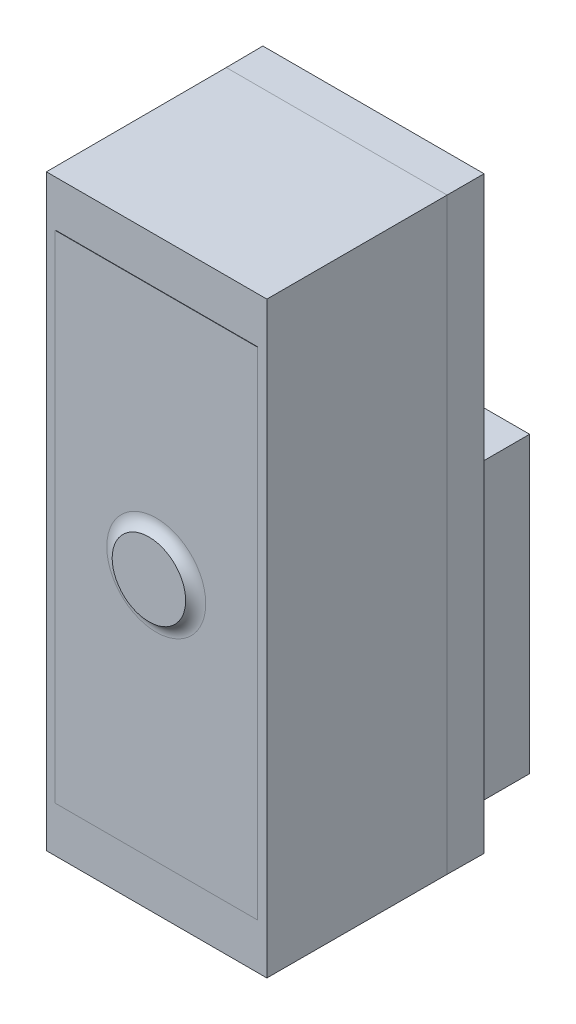
ISO-10303-21;
HEADER;
FILE_DESCRIPTION(('STEP AP214'),'2;1');
FILE_NAME('part.step','',(''),(''),'','','');
FILE_SCHEMA(('AUTOMOTIVE_DESIGN { 1 0 10303 214 1 1 1 1 }'));
ENDSEC;
DATA;
#1=APPLICATION_CONTEXT('core data for automotive mechanical design processes');
#2=APPLICATION_PROTOCOL_DEFINITION('international standard','automotive_design',2000,#1);
#3=PRODUCT_CONTEXT('',#1,'mechanical');
#4=PRODUCT('Part','Part','',(#3));
#5=PRODUCT_RELATED_PRODUCT_CATEGORY('part','',(#4));
#6=PRODUCT_DEFINITION_FORMATION('','',#4);
#7=PRODUCT_DEFINITION_CONTEXT('part definition',#1,'design');
#8=PRODUCT_DEFINITION('design','',#6,#7);
#9=PRODUCT_DEFINITION_SHAPE('','',#8);
#10=(LENGTH_UNIT() NAMED_UNIT(*) SI_UNIT(.MILLI.,.METRE.));
#11=(NAMED_UNIT(*) PLANE_ANGLE_UNIT() SI_UNIT($,.RADIAN.));
#12=(NAMED_UNIT(*) SI_UNIT($,.STERADIAN.) SOLID_ANGLE_UNIT());
#13=UNCERTAINTY_MEASURE_WITH_UNIT(LENGTH_MEASURE(1.E-05),#10,'distance_accuracy_value','');
#14=(GEOMETRIC_REPRESENTATION_CONTEXT(3) GLOBAL_UNCERTAINTY_ASSIGNED_CONTEXT((#13)) GLOBAL_UNIT_ASSIGNED_CONTEXT((#10,
#11,#12)) REPRESENTATION_CONTEXT('',''));
#15=CARTESIAN_POINT('',(0.,0.,0.));
#16=DIRECTION('',(0.,0.,1.));
#17=DIRECTION('',(1.,0.,0.));
#18=AXIS2_PLACEMENT_3D('',#15,#16,#17);
#19=CARTESIAN_POINT('',(-7.53006344851297,3.82801421890761,5.11));
#20=DIRECTION('',(0.,0.,1.));
#21=DIRECTION('',(1.,0.,0.));
#22=AXIS2_PLACEMENT_3D('',#19,#20,#21);
#23=PLANE('',#22);
#24=CARTESIAN_POINT('',(-7.53006344851297,3.82801421890761,5.11));
#25=DIRECTION('',(0.,0.,-1.));
#26=DIRECTION('',(1.,0.,0.));
#27=AXIS2_PLACEMENT_3D('',#24,#25,#26);
#28=CIRCLE('',#27,0.999999999999998);
#29=CARTESIAN_POINT('',(-8.53006344851297,3.82801421890761,5.11));
#30=VERTEX_POINT('',#29);
#31=CARTESIAN_POINT('',(-6.53006344851297,3.82801421890761,5.11));
#32=VERTEX_POINT('',#31);
#33=EDGE_CURVE('E96',#30,#32,#28,.F.);
#34=ORIENTED_EDGE('',*,*,#33,.T.);
#35=CARTESIAN_POINT('',(-7.53006344851297,3.82801421890761,5.11));
#36=DIRECTION('',(0.,0.,-1.));
#37=DIRECTION('',(-1.,0.,0.));
#38=AXIS2_PLACEMENT_3D('',#35,#36,#37);
#39=CIRCLE('',#38,1.);
#40=EDGE_CURVE('E93',#32,#30,#39,.F.);
#41=ORIENTED_EDGE('',*,*,#40,.T.);
#42=EDGE_LOOP('',(#34,#41));
#43=FACE_BOUND('',#42,.T.);
#44=ADVANCED_FACE('F16',(#43),#23,.T.);
#45=CARTESIAN_POINT('',(-9.28006344851297,5.81801421890761,-1.75));
#46=DIRECTION('',(0.,1.,0.));
#47=DIRECTION('',(0.,0.,1.));
#48=AXIS2_PLACEMENT_3D('',#45,#46,#47);
#49=PLANE('',#48);
#50=CARTESIAN_POINT('',(-9.28006344851297,5.81801421890761,-1.75));
#51=DIRECTION('',(0.,-1.,0.));
#52=DIRECTION('',(0.,0.,1.));
#53=AXIS2_PLACEMENT_3D('',#50,#51,#52);
#54=CIRCLE('',#53,0.375000000000001);
#55=CARTESIAN_POINT('',(-9.28006344851297,5.81801421890761,-1.375));
#56=VERTEX_POINT('',#55);
#57=CARTESIAN_POINT('',(-9.28006344851297,5.81801421890761,-2.125));
#58=VERTEX_POINT('',#57);
#59=EDGE_CURVE('E161',#56,#58,#54,.T.);
#60=ORIENTED_EDGE('',*,*,#59,.F.);
#61=CARTESIAN_POINT('',(-9.28006344851297,5.81801421890761,-1.75));
#62=DIRECTION('',(0.,-1.,0.));
#63=DIRECTION('',(0.,0.,-1.));
#64=AXIS2_PLACEMENT_3D('',#61,#62,#63);
#65=CIRCLE('',#64,0.375000000000001);
#66=EDGE_CURVE('E104',#58,#56,#65,.T.);
#67=ORIENTED_EDGE('',*,*,#66,.F.);
#68=EDGE_LOOP('',(#60,#67));
#69=FACE_BOUND('',#68,.T.);
#70=ADVANCED_FACE('F132',(#69),#49,.T.);
#71=CARTESIAN_POINT('',(-7.53006344851297,3.82801421890761,5.31));
#72=DIRECTION('',(0.,0.,-1.));
#73=DIRECTION('',(-1.,0.,0.));
#74=AXIS2_PLACEMENT_3D('',#71,#72,#73);
#75=TOROIDAL_SURFACE('',#74,1.34641016151377,0.4);
#76=CARTESIAN_POINT('',(-7.53006344851297,3.82801421890761,4.91));
#77=DIRECTION('',(0.,0.,1.));
#78=DIRECTION('',(1.,0.,0.));
#79=AXIS2_PLACEMENT_3D('',#76,#77,#78);
#80=CIRCLE('',#79,1.34641016151377);
#81=CARTESIAN_POINT('',(-6.1836532869992,3.82801421890761,4.91));
#82=VERTEX_POINT('',#81);
#83=CARTESIAN_POINT('',(-8.87647361002675,3.82801421890761,4.91));
#84=VERTEX_POINT('',#83);
#85=EDGE_CURVE('E148',#82,#84,#80,.T.);
#86=ORIENTED_EDGE('',*,*,#85,.T.);
#87=CARTESIAN_POINT('',(-7.53006344851297,3.82801421890761,4.91));
#88=DIRECTION('',(0.,0.,1.));
#89=DIRECTION('',(-1.,0.,0.));
#90=AXIS2_PLACEMENT_3D('',#87,#88,#89);
#91=CIRCLE('',#90,1.34641016151378);
#92=EDGE_CURVE('E190',#84,#82,#91,.T.);
#93=ORIENTED_EDGE('',*,*,#92,.T.);
#94=EDGE_LOOP('',(#86,#93));
#95=FACE_BOUND('',#94,.T.);
#96=ORIENTED_EDGE('',*,*,#33,.F.);
#97=ORIENTED_EDGE('',*,*,#40,.F.);
#98=EDGE_LOOP('',(#96,#97));
#99=FACE_BOUND('',#98,.T.);
#100=ADVANCED_FACE('F98',(#95,#99),#75,.F.);
#101=CARTESIAN_POINT('',(-9.28006344851297,5.81801421890761,-1.75));
#102=DIRECTION('',(0.,-1.,0.));
#103=DIRECTION('',(0.,0.,-1.));
#104=AXIS2_PLACEMENT_3D('',#101,#102,#103);
#105=CYLINDRICAL_SURFACE('',#104,0.375000000000001);
#106=ORIENTED_EDGE('',*,*,#66,.T.);
#107=ORIENTED_EDGE('',*,*,#59,.T.);
#108=EDGE_LOOP('',(#106,#107));
#109=FACE_BOUND('',#108,.T.);
#110=CARTESIAN_POINT('',(-9.28006344851297,4.81801421890761,-1.75));
#111=DIRECTION('',(0.,1.,0.));
#112=DIRECTION('',(0.,0.,-1.));
#113=AXIS2_PLACEMENT_3D('',#110,#111,#112);
#114=CIRCLE('',#113,0.375000000000001);
#115=CARTESIAN_POINT('',(-9.28006344851297,4.81801421890761,-2.125));
#116=VERTEX_POINT('',#115);
#117=CARTESIAN_POINT('',(-9.28006344851297,4.81801421890761,-1.375));
#118=VERTEX_POINT('',#117);
#119=EDGE_CURVE('E508',#116,#118,#114,.T.);
#120=ORIENTED_EDGE('',*,*,#119,.T.);
#121=CARTESIAN_POINT('',(-9.28006344851297,4.81801421890761,-1.75));
#122=DIRECTION('',(0.,1.,0.));
#123=DIRECTION('',(0.,0.,1.));
#124=AXIS2_PLACEMENT_3D('',#121,#122,#123);
#125=CIRCLE('',#124,0.375000000000001);
#126=EDGE_CURVE('E509',#118,#116,#125,.T.);
#127=ORIENTED_EDGE('',*,*,#126,.T.);
#128=EDGE_LOOP('',(#120,#127));
#129=FACE_BOUND('',#128,.T.);
#130=ADVANCED_FACE('F131',(#109,#129),#105,.T.);
#131=CARTESIAN_POINT('',(0.,0.,-2.5));
#132=DIRECTION('',(0.,0.,1.));
#133=DIRECTION('',(1.,0.,0.));
#134=AXIS2_PLACEMENT_3D('',#131,#132,#133);
#135=PLANE('',#134);
#136=DIRECTION('',(1.,0.,0.));
#137=VECTOR('',#136,1.);
#138=CARTESIAN_POINT('',(-4.78006344851297,-3.18198578109239,-2.5));
#139=LINE('',#138,#137);
#140=CARTESIAN_POINT('',(-4.78006344851297,-3.18198578109239,-2.5));
#141=VERTEX_POINT('',#140);
#142=CARTESIAN_POINT('',(-10.280063448513,-3.18198578109239,-2.5));
#143=VERTEX_POINT('',#142);
#144=EDGE_CURVE('E191',#141,#143,#139,.F.);
#145=ORIENTED_EDGE('',*,*,#144,.T.);
#146=DIRECTION('',(0.,1.,0.));
#147=VECTOR('',#146,1.);
#148=CARTESIAN_POINT('',(-10.280063448513,-3.18198578109239,-2.5));
#149=LINE('',#148,#147);
#150=CARTESIAN_POINT('',(-10.280063448513,4.81801421890761,-2.5));
#151=VERTEX_POINT('',#150);
#152=EDGE_CURVE('E550',#143,#151,#149,.T.);
#153=ORIENTED_EDGE('',*,*,#152,.T.);
#154=DIRECTION('',(1.,0.,0.));
#155=VECTOR('',#154,1.);
#156=CARTESIAN_POINT('',(-4.78006344851297,4.81801421890761,-2.5));
#157=LINE('',#156,#155);
#158=CARTESIAN_POINT('',(-4.78006344851297,4.81801421890761,-2.5));
#159=VERTEX_POINT('',#158);
#160=EDGE_CURVE('E512',#151,#159,#157,.T.);
#161=ORIENTED_EDGE('',*,*,#160,.T.);
#162=DIRECTION('',(0.,1.,0.));
#163=VECTOR('',#162,1.);
#164=CARTESIAN_POINT('',(-4.78006344851297,-3.18198578109239,-2.5));
#165=LINE('',#164,#163);
#166=EDGE_CURVE('E193',#159,#141,#165,.F.);
#167=ORIENTED_EDGE('',*,*,#166,.T.);
#168=EDGE_LOOP('',(#145,#153,#161,#167));
#169=FACE_BOUND('',#168,.T.);
#170=ADVANCED_FACE('F673',(#169),#135,.F.);
#171=CARTESIAN_POINT('',(0.,0.,4.91));
#172=DIRECTION('',(0.,0.,-1.));
#173=DIRECTION('',(-1.,0.,0.));
#174=AXIS2_PLACEMENT_3D('',#171,#172,#173);
#175=PLANE('',#174);
#176=DIRECTION('',(1.,0.,0.));
#177=VECTOR('',#176,1.);
#178=CARTESIAN_POINT('',(-10.280063448513,10.5780142189076,4.91));
#179=LINE('',#178,#177);
#180=CARTESIAN_POINT('',(-4.78006344851297,10.5780142189076,4.91));
#181=VERTEX_POINT('',#180);
#182=CARTESIAN_POINT('',(-10.280063448513,10.5780142189076,4.91));
#183=VERTEX_POINT('',#182);
#184=EDGE_CURVE('E557',#181,#183,#179,.F.);
#185=ORIENTED_EDGE('',*,*,#184,.T.);
#186=DIRECTION('',(0.,1.,0.));
#187=VECTOR('',#186,1.);
#188=CARTESIAN_POINT('',(-10.280063448513,-2.92198578109239,4.91));
#189=LINE('',#188,#187);
#190=CARTESIAN_POINT('',(-10.280063448513,-2.92198578109239,4.91));
#191=VERTEX_POINT('',#190);
#192=EDGE_CURVE('E623',#183,#191,#189,.F.);
#193=ORIENTED_EDGE('',*,*,#192,.T.);
#194=DIRECTION('',(1.,0.,0.));
#195=VECTOR('',#194,1.);
#196=CARTESIAN_POINT('',(-10.280063448513,-2.92198578109239,4.91));
#197=LINE('',#196,#195);
#198=CARTESIAN_POINT('',(-4.78006344851297,-2.92198578109239,4.91));
#199=VERTEX_POINT('',#198);
#200=EDGE_CURVE('E631',#191,#199,#197,.T.);
#201=ORIENTED_EDGE('',*,*,#200,.T.);
#202=DIRECTION('',(0.,1.,0.));
#203=VECTOR('',#202,1.);
#204=CARTESIAN_POINT('',(-4.78006344851297,-2.92198578109239,4.91));
#205=LINE('',#204,#203);
#206=EDGE_CURVE('E559',#199,#181,#205,.T.);
#207=ORIENTED_EDGE('',*,*,#206,.T.);
#208=EDGE_LOOP('',(#185,#193,#201,#207));
#209=FACE_BOUND('',#208,.T.);
#210=ORIENTED_EDGE('',*,*,#92,.F.);
#211=ORIENTED_EDGE('',*,*,#85,.F.);
#212=EDGE_LOOP('',(#210,#211));
#213=FACE_BOUND('',#212,.T.);
#214=ADVANCED_FACE('F269',(#209,#213),#175,.F.);
#215=CARTESIAN_POINT('',(-4.52006344851297,0.,-1.));
#216=DIRECTION('',(-1.,0.,0.));
#217=DIRECTION('',(0.,0.,1.));
#218=AXIS2_PLACEMENT_3D('',#215,#216,#217);
#219=PLANE('',#218);
#220=CARTESIAN_POINT('',(-4.52006344851297,-4.18198578109239,0.));
#221=DIRECTION('',(0.,0.,-1.));
#222=VECTOR('',#221,1.);
#223=LINE('',#220,#222);
#224=CARTESIAN_POINT('',(-4.52506344851297,-4.17698578109239,0.));
#225=VERTEX_POINT('',#224);
#226=CARTESIAN_POINT('',(-4.52006344851297,-4.18198578109239,-1.));
#227=VERTEX_POINT('',#226);
#228=EDGE_CURVE('E251',#225,#227,#223,.T.);
#229=ORIENTED_EDGE('',*,*,#228,.T.);
#230=DIRECTION('',(0.,1.,0.));
#231=VECTOR('',#230,1.);
#232=CARTESIAN_POINT('',(-4.52006344851297,0.,-1.));
#233=LINE('',#232,#231);
#234=CARTESIAN_POINT('',(-4.52006344851297,11.8380142189076,-1.));
#235=VERTEX_POINT('',#234);
#236=EDGE_CURVE('E256',#235,#227,#233,.F.);
#237=ORIENTED_EDGE('',*,*,#236,.F.);
#238=CARTESIAN_POINT('',(-4.52506344851297,11.8380142189076,0.));
#239=DIRECTION('',(0.00499993750117165,0.,-0.99998750023437));
#240=VECTOR('',#239,1.);
#241=LINE('',#238,#240);
#242=CARTESIAN_POINT('',(-4.52506344851297,11.8330142189076,0.));
#243=VERTEX_POINT('',#242);
#244=EDGE_CURVE('E491',#243,#235,#241,.T.);
#245=ORIENTED_EDGE('',*,*,#244,.F.);
#246=CARTESIAN_POINT('',(-4.53006344851297,-4.17698578109238,0.));
#247=DIRECTION('',(0.,1.,0.));
#248=VECTOR('',#247,1.);
#249=LINE('',#246,#248);
#250=EDGE_CURVE('E580',#225,#243,#249,.T.);
#251=ORIENTED_EDGE('',*,*,#250,.F.);
#252=EDGE_LOOP('',(#229,#237,#245,#251));
#253=FACE_BOUND('',#252,.T.);
#254=ADVANCED_FACE('F258',(#253),#219,.F.);
#255=CARTESIAN_POINT('',(-4.78006344851297,-3.18198578109239,-2.5));
#256=DIRECTION('',(0.,1.,0.));
#257=DIRECTION('',(0.,0.,1.));
#258=AXIS2_PLACEMENT_3D('',#255,#256,#257);
#259=PLANE('',#258);
#260=DIRECTION('',(0.,0.,-1.));
#261=VECTOR('',#260,1.);
#262=CARTESIAN_POINT('',(-10.280063448513,-3.18198578109239,-2.5));
#263=LINE('',#262,#261);
#264=CARTESIAN_POINT('',(-10.280063448513,-3.18198578109239,-1.));
#265=VERTEX_POINT('',#264);
#266=EDGE_CURVE('E525',#265,#143,#263,.T.);
#267=ORIENTED_EDGE('',*,*,#266,.T.);
#268=ORIENTED_EDGE('',*,*,#144,.F.);
#269=DIRECTION('',(0.,0.,1.));
#270=VECTOR('',#269,1.);
#271=CARTESIAN_POINT('',(-4.78006344851297,-3.18198578109239,-2.5));
#272=LINE('',#271,#270);
#273=CARTESIAN_POINT('',(-4.78006344851297,-3.18198578109239,-1.));
#274=VERTEX_POINT('',#273);
#275=EDGE_CURVE('E201',#141,#274,#272,.T.);
#276=ORIENTED_EDGE('',*,*,#275,.T.);
#277=DIRECTION('',(-1.,0.,0.));
#278=VECTOR('',#277,1.);
#279=CARTESIAN_POINT('',(0.,-3.18198578109239,-1.));
#280=LINE('',#279,#278);
#281=EDGE_CURVE('E345',#265,#274,#280,.F.);
#282=ORIENTED_EDGE('',*,*,#281,.F.);
#283=EDGE_LOOP('',(#267,#268,#276,#282));
#284=FACE_BOUND('',#283,.T.);
#285=ADVANCED_FACE('F268',(#284),#259,.F.);
#286=CARTESIAN_POINT('',(-4.78006344851297,-3.18198578109239,-2.5));
#287=DIRECTION('',(-1.,0.,0.));
#288=DIRECTION('',(0.,0.,1.));
#289=AXIS2_PLACEMENT_3D('',#286,#287,#288);
#290=PLANE('',#289);
#291=ORIENTED_EDGE('',*,*,#275,.F.);
#292=ORIENTED_EDGE('',*,*,#166,.F.);
#293=DIRECTION('',(0.,0.,-1.));
#294=VECTOR('',#293,1.);
#295=CARTESIAN_POINT('',(-4.78006344851297,4.81801421890761,-2.5));
#296=LINE('',#295,#294);
#297=CARTESIAN_POINT('',(-4.78006344851297,4.81801421890761,-1.));
#298=VERTEX_POINT('',#297);
#299=EDGE_CURVE('E514',#159,#298,#296,.F.);
#300=ORIENTED_EDGE('',*,*,#299,.T.);
#301=DIRECTION('',(0.,1.,0.));
#302=VECTOR('',#301,1.);
#303=CARTESIAN_POINT('',(-4.78006344851297,0.,-1.));
#304=LINE('',#303,#302);
#305=EDGE_CURVE('E909',#274,#298,#304,.T.);
#306=ORIENTED_EDGE('',*,*,#305,.F.);
#307=EDGE_LOOP('',(#291,#292,#300,#306));
#308=FACE_BOUND('',#307,.T.);
#309=ADVANCED_FACE('F537',(#308),#290,.F.);
#310=CARTESIAN_POINT('',(-4.78006344851297,4.81801421890761,-2.5));
#311=DIRECTION('',(0.,-1.,0.));
#312=DIRECTION('',(0.,0.,-1.));
#313=AXIS2_PLACEMENT_3D('',#310,#311,#312);
#314=PLANE('',#313);
#315=ORIENTED_EDGE('',*,*,#299,.F.);
#316=ORIENTED_EDGE('',*,*,#160,.F.);
#317=DIRECTION('',(0.,0.,-1.));
#318=VECTOR('',#317,1.);
#319=CARTESIAN_POINT('',(-10.280063448513,4.81801421890761,-2.5));
#320=LINE('',#319,#318);
#321=CARTESIAN_POINT('',(-10.280063448513,4.81801421890761,-1.));
#322=VERTEX_POINT('',#321);
#323=EDGE_CURVE('E458',#151,#322,#320,.F.);
#324=ORIENTED_EDGE('',*,*,#323,.T.);
#325=DIRECTION('',(-1.,0.,0.));
#326=VECTOR('',#325,1.);
#327=CARTESIAN_POINT('',(0.,4.81801421890761,-1.));
#328=LINE('',#327,#326);
#329=EDGE_CURVE('E672',#298,#322,#328,.T.);
#330=ORIENTED_EDGE('',*,*,#329,.F.);
#331=EDGE_LOOP('',(#315,#316,#324,#330));
#332=FACE_BOUND('',#331,.T.);
#333=ORIENTED_EDGE('',*,*,#126,.F.);
#334=ORIENTED_EDGE('',*,*,#119,.F.);
#335=EDGE_LOOP('',(#333,#334));
#336=FACE_BOUND('',#335,.T.);
#337=ADVANCED_FACE('F529',(#332,#336),#314,.F.);
#338=CARTESIAN_POINT('',(-10.280063448513,-3.18198578109239,-2.5));
#339=DIRECTION('',(1.,0.,0.));
#340=DIRECTION('',(0.,0.,-1.));
#341=AXIS2_PLACEMENT_3D('',#338,#339,#340);
#342=PLANE('',#341);
#343=ORIENTED_EDGE('',*,*,#323,.F.);
#344=ORIENTED_EDGE('',*,*,#152,.F.);
#345=ORIENTED_EDGE('',*,*,#266,.F.);
#346=DIRECTION('',(0.,1.,0.));
#347=VECTOR('',#346,1.);
#348=CARTESIAN_POINT('',(-10.280063448513,0.,-1.));
#349=LINE('',#348,#347);
#350=EDGE_CURVE('E416',#322,#265,#349,.F.);
#351=ORIENTED_EDGE('',*,*,#350,.F.);
#352=EDGE_LOOP('',(#343,#344,#345,#351));
#353=FACE_BOUND('',#352,.T.);
#354=ADVANCED_FACE('F471',(#353),#342,.F.);
#355=CARTESIAN_POINT('',(0.,11.8380142189076,-1.));
#356=DIRECTION('',(0.,1.,0.));
#357=DIRECTION('',(0.,0.,1.));
#358=AXIS2_PLACEMENT_3D('',#355,#356,#357);
#359=PLANE('',#358);
#360=DIRECTION('',(-1.,0.,0.));
#361=VECTOR('',#360,1.);
#362=CARTESIAN_POINT('',(0.,11.8380142189076,-1.));
#363=LINE('',#362,#361);
#364=CARTESIAN_POINT('',(-10.540063448513,11.8380142189076,-1.));
#365=VERTEX_POINT('',#364);
#366=EDGE_CURVE('E480',#365,#235,#363,.F.);
#367=ORIENTED_EDGE('',*,*,#366,.F.);
#368=CARTESIAN_POINT('',(-10.540063448513,11.8380142189076,-1.));
#369=DIRECTION('',(0.00499993750116991,0.,0.99998750023437));
#370=VECTOR('',#369,1.);
#371=LINE('',#368,#370);
#372=CARTESIAN_POINT('',(-10.5346959010366,11.8333817663839,0.));
#373=VERTEX_POINT('',#372);
#374=EDGE_CURVE('E306',#365,#373,#371,.T.);
#375=ORIENTED_EDGE('',*,*,#374,.T.);
#376=CARTESIAN_POINT('',(-4.52506344851297,11.8280142189076,0.));
#377=DIRECTION('',(-1.,0.,0.));
#378=VECTOR('',#377,1.);
#379=LINE('',#376,#378);
#380=EDGE_CURVE('E443',#243,#373,#379,.T.);
#381=ORIENTED_EDGE('',*,*,#380,.F.);
#382=ORIENTED_EDGE('',*,*,#244,.T.);
#383=EDGE_LOOP('',(#367,#375,#381,#382));
#384=FACE_BOUND('',#383,.T.);
#385=ADVANCED_FACE('F460',(#384),#359,.T.);
#386=CARTESIAN_POINT('',(-10.280063448513,10.5780142189076,4.91));
#387=DIRECTION('',(0.,-1.,0.));
#388=DIRECTION('',(0.,0.,-1.));
#389=AXIS2_PLACEMENT_3D('',#386,#387,#388);
#390=PLANE('',#389);
#391=DIRECTION('',(0.,0.,-1.));
#392=VECTOR('',#391,1.);
#393=CARTESIAN_POINT('',(-10.280063448513,10.5780142189076,4.91));
#394=LINE('',#393,#392);
#395=CARTESIAN_POINT('',(-10.280063448513,10.5780142189076,4.9));
#396=VERTEX_POINT('',#395);
#397=EDGE_CURVE('E625',#396,#183,#394,.F.);
#398=ORIENTED_EDGE('',*,*,#397,.T.);
#399=ORIENTED_EDGE('',*,*,#184,.F.);
#400=DIRECTION('',(0.,0.,1.));
#401=VECTOR('',#400,1.);
#402=CARTESIAN_POINT('',(-4.78006344851297,10.5780142189076,4.91));
#403=LINE('',#402,#401);
#404=CARTESIAN_POINT('',(-4.78006344851297,10.5780142189076,4.9));
#405=VERTEX_POINT('',#404);
#406=EDGE_CURVE('E567',#181,#405,#403,.F.);
#407=ORIENTED_EDGE('',*,*,#406,.T.);
#408=DIRECTION('',(1.,0.,0.));
#409=VECTOR('',#408,1.);
#410=CARTESIAN_POINT('',(0.,10.5780142189076,4.9));
#411=LINE('',#410,#409);
#412=EDGE_CURVE('E388',#396,#405,#411,.T.);
#413=ORIENTED_EDGE('',*,*,#412,.F.);
#414=EDGE_LOOP('',(#398,#399,#407,#413));
#415=FACE_BOUND('',#414,.T.);
#416=ADVANCED_FACE('F470',(#415),#390,.F.);
#417=CARTESIAN_POINT('',(-4.78006344851297,-2.92198578109239,4.91));
#418=DIRECTION('',(-1.,0.,0.));
#419=DIRECTION('',(0.,0.,1.));
#420=AXIS2_PLACEMENT_3D('',#417,#418,#419);
#421=PLANE('',#420);
#422=ORIENTED_EDGE('',*,*,#406,.F.);
#423=ORIENTED_EDGE('',*,*,#206,.F.);
#424=DIRECTION('',(0.,0.,1.));
#425=VECTOR('',#424,1.);
#426=CARTESIAN_POINT('',(-4.78006344851297,-2.92198578109239,4.91));
#427=LINE('',#426,#425);
#428=CARTESIAN_POINT('',(-4.78006344851297,-2.92198578109239,4.9));
#429=VERTEX_POINT('',#428);
#430=EDGE_CURVE('E628',#199,#429,#427,.F.);
#431=ORIENTED_EDGE('',*,*,#430,.T.);
#432=DIRECTION('',(0.,1.,0.));
#433=VECTOR('',#432,1.);
#434=CARTESIAN_POINT('',(-4.78006344851297,0.,4.9));
#435=LINE('',#434,#433);
#436=EDGE_CURVE('E385',#405,#429,#435,.F.);
#437=ORIENTED_EDGE('',*,*,#436,.F.);
#438=EDGE_LOOP('',(#422,#423,#431,#437));
#439=FACE_BOUND('',#438,.T.);
#440=ADVANCED_FACE('F644',(#439),#421,.F.);
#441=CARTESIAN_POINT('',(-10.280063448513,-2.92198578109239,4.91));
#442=DIRECTION('',(0.,1.,0.));
#443=DIRECTION('',(0.,0.,1.));
#444=AXIS2_PLACEMENT_3D('',#441,#442,#443);
#445=PLANE('',#444);
#446=ORIENTED_EDGE('',*,*,#430,.F.);
#447=ORIENTED_EDGE('',*,*,#200,.F.);
#448=DIRECTION('',(0.,0.,-1.));
#449=VECTOR('',#448,1.);
#450=CARTESIAN_POINT('',(-10.280063448513,-2.92198578109239,4.91));
#451=LINE('',#450,#449);
#452=CARTESIAN_POINT('',(-10.280063448513,-2.92198578109239,4.9));
#453=VERTEX_POINT('',#452);
#454=EDGE_CURVE('E620',#191,#453,#451,.T.);
#455=ORIENTED_EDGE('',*,*,#454,.T.);
#456=DIRECTION('',(1.,0.,0.));
#457=VECTOR('',#456,1.);
#458=CARTESIAN_POINT('',(0.,-2.92198578109239,4.9));
#459=LINE('',#458,#457);
#460=EDGE_CURVE('E371',#429,#453,#459,.F.);
#461=ORIENTED_EDGE('',*,*,#460,.F.);
#462=EDGE_LOOP('',(#446,#447,#455,#461));
#463=FACE_BOUND('',#462,.T.);
#464=ADVANCED_FACE('F725',(#463),#445,.F.);
#465=CARTESIAN_POINT('',(-10.280063448513,-2.92198578109239,4.91));
#466=DIRECTION('',(1.,0.,0.));
#467=DIRECTION('',(0.,0.,-1.));
#468=AXIS2_PLACEMENT_3D('',#465,#466,#467);
#469=PLANE('',#468);
#470=ORIENTED_EDGE('',*,*,#454,.F.);
#471=ORIENTED_EDGE('',*,*,#192,.F.);
#472=ORIENTED_EDGE('',*,*,#397,.F.);
#473=DIRECTION('',(0.,1.,0.));
#474=VECTOR('',#473,1.);
#475=CARTESIAN_POINT('',(-10.280063448513,0.,4.9));
#476=LINE('',#475,#474);
#477=EDGE_CURVE('E365',#453,#396,#476,.T.);
#478=ORIENTED_EDGE('',*,*,#477,.F.);
#479=EDGE_LOOP('',(#470,#471,#472,#478));
#480=FACE_BOUND('',#479,.T.);
#481=ADVANCED_FACE('F719',(#480),#469,.F.);
#482=CARTESIAN_POINT('',(-4.53006344851297,11.8280142189076,4.9));
#483=DIRECTION('',(1.,0.,0.));
#484=DIRECTION('',(0.,1.,0.));
#485=AXIS2_PLACEMENT_3D('',#482,#483,#484);
#486=PLANE('',#485);
#487=DIRECTION('',(0.,1.,0.));
#488=VECTOR('',#487,1.);
#489=CARTESIAN_POINT('',(-4.53006344851297,0.,4.9));
#490=LINE('',#489,#488);
#491=CARTESIAN_POINT('',(-4.53006344851297,-4.17198578109239,4.9));
#492=VERTEX_POINT('',#491);
#493=CARTESIAN_POINT('',(-4.53006344851297,11.8280142189076,4.9));
#494=VERTEX_POINT('',#493);
#495=EDGE_CURVE('E394',#492,#494,#490,.T.);
#496=ORIENTED_EDGE('',*,*,#495,.F.);
#497=CARTESIAN_POINT('',(-4.53006344851297,-4.17198578109239,4.9));
#498=DIRECTION('',(0.,0.,-1.));
#499=VECTOR('',#498,1.);
#500=LINE('',#497,#499);
#501=EDGE_CURVE('E355',#492,#225,#500,.T.);
#502=ORIENTED_EDGE('',*,*,#501,.T.);
#503=ORIENTED_EDGE('',*,*,#250,.T.);
#504=CARTESIAN_POINT('',(-4.53006344851297,11.8280142189076,4.9));
#505=DIRECTION('',(0.00102040763202462,0.,-0.999999479383997));
#506=VECTOR('',#505,1.);
#507=LINE('',#504,#506);
#508=EDGE_CURVE('E572',#494,#243,#507,.T.);
#509=ORIENTED_EDGE('',*,*,#508,.F.);
#510=EDGE_LOOP('',(#496,#502,#503,#509));
#511=FACE_BOUND('',#510,.T.);
#512=ADVANCED_FACE('F224',(#511),#486,.T.);
#513=CARTESIAN_POINT('',(0.,-4.18198578109239,-1.));
#514=DIRECTION('',(0.,1.,0.));
#515=DIRECTION('',(0.,0.,1.));
#516=AXIS2_PLACEMENT_3D('',#513,#514,#515);
#517=PLANE('',#516);
#518=CARTESIAN_POINT('',(-10.540063448513,-4.18198578109239,-1.));
#519=DIRECTION('',(0.,0.,1.));
#520=VECTOR('',#519,1.);
#521=LINE('',#518,#520);
#522=CARTESIAN_POINT('',(-10.540063448513,-4.18198578109239,-1.));
#523=VERTEX_POINT('',#522);
#524=CARTESIAN_POINT('',(-10.5346959010366,-4.17735332856872,0.));
#525=VERTEX_POINT('',#524);
#526=EDGE_CURVE('E35',#523,#525,#521,.T.);
#527=ORIENTED_EDGE('',*,*,#526,.F.);
#528=DIRECTION('',(-1.,0.,0.));
#529=VECTOR('',#528,1.);
#530=CARTESIAN_POINT('',(0.,-4.18198578109239,-1.));
#531=LINE('',#530,#529);
#532=EDGE_CURVE('E338',#227,#523,#531,.T.);
#533=ORIENTED_EDGE('',*,*,#532,.F.);
#534=ORIENTED_EDGE('',*,*,#228,.F.);
#535=CARTESIAN_POINT('',(-4.52506344851297,-4.18198578109239,0.));
#536=DIRECTION('',(-1.,0.,0.));
#537=VECTOR('',#536,1.);
#538=LINE('',#535,#537);
#539=EDGE_CURVE('E350',#225,#525,#538,.T.);
#540=ORIENTED_EDGE('',*,*,#539,.T.);
#541=EDGE_LOOP('',(#527,#533,#534,#540));
#542=FACE_BOUND('',#541,.T.);
#543=ADVANCED_FACE('F213',(#542),#517,.F.);
#544=CARTESIAN_POINT('',(0.,0.,-1.));
#545=DIRECTION('',(0.,0.,-1.));
#546=DIRECTION('',(-1.,0.,0.));
#547=AXIS2_PLACEMENT_3D('',#544,#545,#546);
#548=PLANE('',#547);
#549=ORIENTED_EDGE('',*,*,#329,.T.);
#550=ORIENTED_EDGE('',*,*,#350,.T.);
#551=ORIENTED_EDGE('',*,*,#281,.T.);
#552=ORIENTED_EDGE('',*,*,#305,.T.);
#553=EDGE_LOOP('',(#549,#550,#551,#552));
#554=FACE_BOUND('',#553,.T.);
#555=ORIENTED_EDGE('',*,*,#532,.T.);
#556=DIRECTION('',(0.,1.,0.));
#557=VECTOR('',#556,1.);
#558=CARTESIAN_POINT('',(-10.540063448513,0.,-1.));
#559=LINE('',#558,#557);
#560=EDGE_CURVE('E348',#365,#523,#559,.F.);
#561=ORIENTED_EDGE('',*,*,#560,.F.);
#562=ORIENTED_EDGE('',*,*,#366,.T.);
#563=ORIENTED_EDGE('',*,*,#236,.T.);
#564=EDGE_LOOP('',(#555,#561,#562,#563));
#565=FACE_BOUND('',#564,.T.);
#566=ADVANCED_FACE('F223',(#554,#565),#548,.T.);
#567=CARTESIAN_POINT('',(-10.530063448513,11.8280142189076,4.9));
#568=DIRECTION('',(0.,1.,0.));
#569=DIRECTION('',(0.,0.,1.));
#570=AXIS2_PLACEMENT_3D('',#567,#568,#569);
#571=PLANE('',#570);
#572=DIRECTION('',(1.,0.,0.));
#573=VECTOR('',#572,1.);
#574=CARTESIAN_POINT('',(0.,11.8280142189076,4.9));
#575=LINE('',#574,#573);
#576=CARTESIAN_POINT('',(-10.530063448513,11.8280142189076,4.9));
#577=VERTEX_POINT('',#576);
#578=EDGE_CURVE('E391',#494,#577,#575,.F.);
#579=ORIENTED_EDGE('',*,*,#578,.F.);
#580=ORIENTED_EDGE('',*,*,#508,.T.);
#581=ORIENTED_EDGE('',*,*,#380,.T.);
#582=CARTESIAN_POINT('',(-10.530063448513,11.8280142189076,0.));
#583=DIRECTION('',(0.,0.,1.));
#584=VECTOR('',#583,1.);
#585=LINE('',#582,#584);
#586=EDGE_CURVE('E349',#373,#577,#585,.T.);
#587=ORIENTED_EDGE('',*,*,#586,.T.);
#588=EDGE_LOOP('',(#579,#580,#581,#587));
#589=FACE_BOUND('',#588,.T.);
#590=ADVANCED_FACE('F418',(#589),#571,.T.);
#591=CARTESIAN_POINT('',(0.,0.,4.9));
#592=DIRECTION('',(0.,0.,1.));
#593=DIRECTION('',(1.,0.,0.));
#594=AXIS2_PLACEMENT_3D('',#591,#592,#593);
#595=PLANE('',#594);
#596=ORIENTED_EDGE('',*,*,#460,.T.);
#597=ORIENTED_EDGE('',*,*,#477,.T.);
#598=ORIENTED_EDGE('',*,*,#412,.T.);
#599=ORIENTED_EDGE('',*,*,#436,.T.);
#600=EDGE_LOOP('',(#596,#597,#598,#599));
#601=FACE_BOUND('',#600,.T.);
#602=ORIENTED_EDGE('',*,*,#495,.T.);
#603=ORIENTED_EDGE('',*,*,#578,.T.);
#604=DIRECTION('',(0.,1.,0.));
#605=VECTOR('',#604,1.);
#606=CARTESIAN_POINT('',(-10.530063448513,11.8280142189076,4.9));
#607=LINE('',#606,#605);
#608=CARTESIAN_POINT('',(-10.530063448513,-4.17198578109239,4.9));
#609=VERTEX_POINT('',#608);
#610=EDGE_CURVE('E354',#577,#609,#607,.F.);
#611=ORIENTED_EDGE('',*,*,#610,.T.);
#612=DIRECTION('',(1.,0.,0.));
#613=VECTOR('',#612,1.);
#614=CARTESIAN_POINT('',(-10.530063448513,-4.17198578109239,4.9));
#615=LINE('',#614,#613);
#616=EDGE_CURVE('E359',#609,#492,#615,.T.);
#617=ORIENTED_EDGE('',*,*,#616,.T.);
#618=EDGE_LOOP('',(#602,#603,#611,#617));
#619=FACE_BOUND('',#618,.T.);
#620=ADVANCED_FACE('F426',(#601,#619),#595,.T.);
#621=CARTESIAN_POINT('',(-10.530063448513,-4.17198578109239,4.9));
#622=DIRECTION('',(0.,1.,0.));
#623=DIRECTION('',(0.,0.,1.));
#624=AXIS2_PLACEMENT_3D('',#621,#622,#623);
#625=PLANE('',#624);
#626=ORIENTED_EDGE('',*,*,#501,.F.);
#627=ORIENTED_EDGE('',*,*,#616,.F.);
#628=CARTESIAN_POINT('',(-10.530063448513,-4.17198578109239,4.9));
#629=DIRECTION('',(0.,0.,-1.));
#630=VECTOR('',#629,1.);
#631=LINE('',#628,#630);
#632=EDGE_CURVE('E28',#609,#525,#631,.T.);
#633=ORIENTED_EDGE('',*,*,#632,.T.);
#634=ORIENTED_EDGE('',*,*,#539,.F.);
#635=EDGE_LOOP('',(#626,#627,#633,#634));
#636=FACE_BOUND('',#635,.T.);
#637=ADVANCED_FACE('F324',(#636),#625,.F.);
#638=CARTESIAN_POINT('',(-10.540063448513,0.,-1.));
#639=DIRECTION('',(-1.,0.,0.));
#640=DIRECTION('',(0.,0.,1.));
#641=AXIS2_PLACEMENT_3D('',#638,#639,#640);
#642=PLANE('',#641);
#643=ORIENTED_EDGE('',*,*,#560,.T.);
#644=ORIENTED_EDGE('',*,*,#526,.T.);
#645=CARTESIAN_POINT('',(-10.540063448513,-4.17698578109239,0.));
#646=DIRECTION('',(0.,1.,0.));
#647=VECTOR('',#646,1.);
#648=LINE('',#645,#647);
#649=EDGE_CURVE('E10',#525,#373,#648,.T.);
#650=ORIENTED_EDGE('',*,*,#649,.T.);
#651=ORIENTED_EDGE('',*,*,#374,.F.);
#652=EDGE_LOOP('',(#643,#644,#650,#651));
#653=FACE_BOUND('',#652,.T.);
#654=ADVANCED_FACE('F313',(#653),#642,.T.);
#655=CARTESIAN_POINT('',(-10.530063448513,11.8280142189076,4.9));
#656=DIRECTION('',(1.,0.,0.));
#657=DIRECTION('',(0.,1.,0.));
#658=AXIS2_PLACEMENT_3D('',#655,#656,#657);
#659=PLANE('',#658);
#660=ORIENTED_EDGE('',*,*,#632,.F.);
#661=ORIENTED_EDGE('',*,*,#610,.F.);
#662=ORIENTED_EDGE('',*,*,#586,.F.);
#663=ORIENTED_EDGE('',*,*,#649,.F.);
#664=EDGE_LOOP('',(#660,#661,#662,#663));
#665=FACE_BOUND('',#664,.T.);
#666=ADVANCED_FACE('F323',(#665),#659,.F.);
#667=CLOSED_SHELL('',(#44,#70,#100,#130,#170,#214,#254,#285,#309,#337,#354,#385,#416,#440,#464,
#481,#512,#543,#566,#590,#620,#637,#654,#666));
#668=MANIFOLD_SOLID_BREP('B1',#667);
#669=ADVANCED_BREP_SHAPE_REPRESENTATION('',(#18,#668),#14);
#670=SHAPE_DEFINITION_REPRESENTATION(#9,#669);
ENDSEC;
END-ISO-10303-21;
